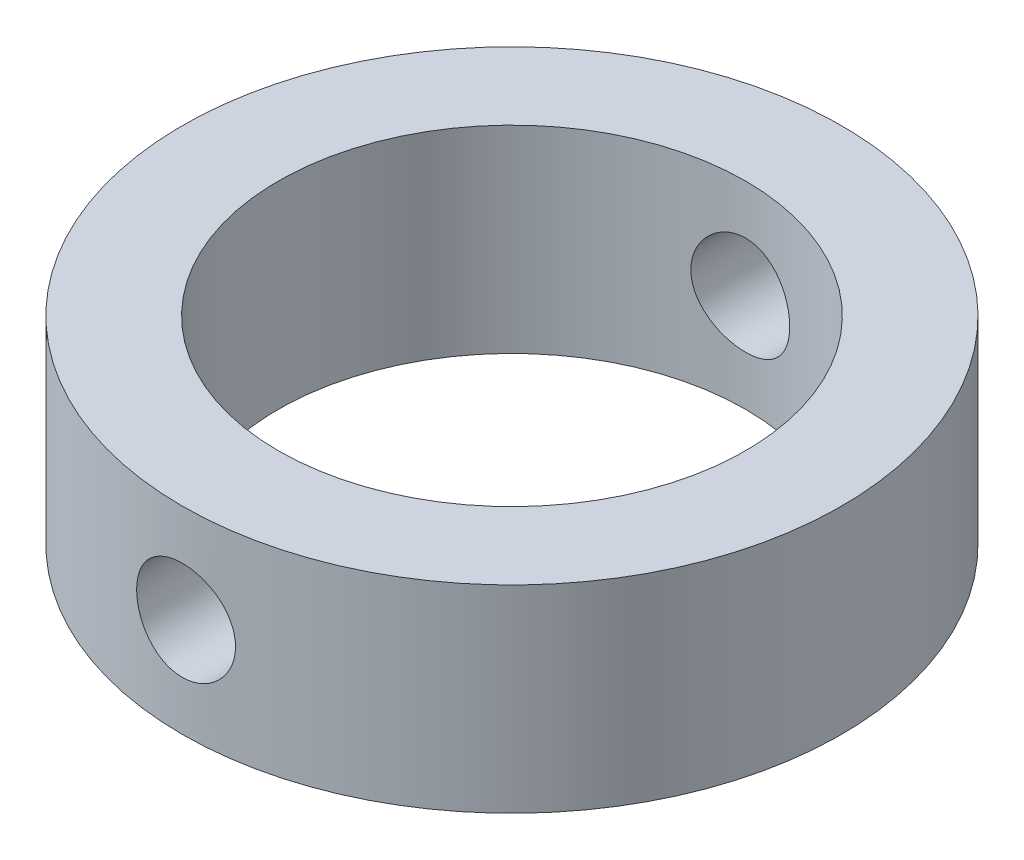
ISO-10303-21;
HEADER;
FILE_DESCRIPTION(('STEP AP214'),'2;1');
FILE_NAME('part.step','',(''),(''),'','','');
FILE_SCHEMA(('AUTOMOTIVE_DESIGN { 1 0 10303 214 1 1 1 1 }'));
ENDSEC;
DATA;
#1=APPLICATION_CONTEXT('core data for automotive mechanical design processes');
#2=APPLICATION_PROTOCOL_DEFINITION('international standard','automotive_design',2000,#1);
#3=PRODUCT_CONTEXT('',#1,'mechanical');
#4=PRODUCT('Part','Part','',(#3));
#5=PRODUCT_RELATED_PRODUCT_CATEGORY('part','',(#4));
#6=PRODUCT_DEFINITION_FORMATION('','',#4);
#7=PRODUCT_DEFINITION_CONTEXT('part definition',#1,'design');
#8=PRODUCT_DEFINITION('design','',#6,#7);
#9=PRODUCT_DEFINITION_SHAPE('','',#8);
#10=(LENGTH_UNIT() NAMED_UNIT(*) SI_UNIT(.MILLI.,.METRE.));
#11=(NAMED_UNIT(*) PLANE_ANGLE_UNIT() SI_UNIT($,.RADIAN.));
#12=(NAMED_UNIT(*) SI_UNIT($,.STERADIAN.) SOLID_ANGLE_UNIT());
#13=UNCERTAINTY_MEASURE_WITH_UNIT(LENGTH_MEASURE(1.E-05),#10,'distance_accuracy_value','');
#14=(GEOMETRIC_REPRESENTATION_CONTEXT(3) GLOBAL_UNCERTAINTY_ASSIGNED_CONTEXT((#13)) GLOBAL_UNIT_ASSIGNED_CONTEXT((#10,
#11,#12)) REPRESENTATION_CONTEXT('',''));
#15=CARTESIAN_POINT('',(0.,0.,0.));
#16=DIRECTION('',(0.,0.,1.));
#17=DIRECTION('',(1.,0.,0.));
#18=AXIS2_PLACEMENT_3D('',#15,#16,#17);
#19=CARTESIAN_POINT('',(0.,7.50000000000001,0.));
#20=DIRECTION('',(0.,1.,0.));
#21=DIRECTION('',(0.,0.,1.));
#22=AXIS2_PLACEMENT_3D('',#19,#20,#21);
#23=PLANE('',#22);
#24=CARTESIAN_POINT('',(0.,7.50000000000001,0.));
#25=DIRECTION('',(0.,1.,0.));
#26=DIRECTION('',(0.,0.,1.));
#27=AXIS2_PLACEMENT_3D('',#24,#25,#26);
#28=CIRCLE('',#27,25.);
#29=CARTESIAN_POINT('',(0.,7.50000000000001,25.));
#30=VERTEX_POINT('',#29);
#31=EDGE_CURVE('E10',#30,#30,#28,.T.);
#32=ORIENTED_EDGE('',*,*,#31,.T.);
#33=EDGE_LOOP('',(#32));
#34=FACE_BOUND('',#33,.T.);
#35=CARTESIAN_POINT('',(0.,7.50000000000001,0.));
#36=DIRECTION('',(0.,1.,0.));
#37=DIRECTION('',(0.,0.,1.));
#38=AXIS2_PLACEMENT_3D('',#35,#36,#37);
#39=CIRCLE('',#38,17.7222);
#40=CARTESIAN_POINT('',(0.,7.50000000000001,17.7222));
#41=VERTEX_POINT('',#40);
#42=EDGE_CURVE('E67',#41,#41,#39,.T.);
#43=ORIENTED_EDGE('',*,*,#42,.F.);
#44=EDGE_LOOP('',(#43));
#45=FACE_BOUND('',#44,.T.);
#46=ADVANCED_FACE('F44',(#34,#45),#23,.T.);
#47=CARTESIAN_POINT('',(0.,-7.50000000000001,0.));
#48=DIRECTION('',(0.,1.,0.));
#49=DIRECTION('',(0.,0.,1.));
#50=AXIS2_PLACEMENT_3D('',#47,#48,#49);
#51=PLANE('',#50);
#52=CARTESIAN_POINT('',(0.,-7.50000000000001,0.));
#53=DIRECTION('',(0.,1.,0.));
#54=DIRECTION('',(0.,0.,1.));
#55=AXIS2_PLACEMENT_3D('',#52,#53,#54);
#56=CIRCLE('',#55,25.);
#57=CARTESIAN_POINT('',(0.,-7.50000000000001,25.));
#58=VERTEX_POINT('',#57);
#59=EDGE_CURVE('E59',#58,#58,#56,.T.);
#60=ORIENTED_EDGE('',*,*,#59,.F.);
#61=EDGE_LOOP('',(#60));
#62=FACE_BOUND('',#61,.T.);
#63=CARTESIAN_POINT('',(0.,-7.50000000000001,0.));
#64=DIRECTION('',(0.,1.,0.));
#65=DIRECTION('',(0.,0.,1.));
#66=AXIS2_PLACEMENT_3D('',#63,#64,#65);
#67=CIRCLE('',#66,17.7222);
#68=CARTESIAN_POINT('',(0.,-7.50000000000001,17.7222));
#69=VERTEX_POINT('',#68);
#70=EDGE_CURVE('E70',#69,#69,#67,.T.);
#71=ORIENTED_EDGE('',*,*,#70,.T.);
#72=EDGE_LOOP('',(#71));
#73=FACE_BOUND('',#72,.T.);
#74=ADVANCED_FACE('F115',(#62,#73),#51,.F.);
#75=CARTESIAN_POINT('',(0.,7.50000000000001,0.));
#76=DIRECTION('',(0.,-1.,0.));
#77=DIRECTION('',(0.,0.,-1.));
#78=AXIS2_PLACEMENT_3D('',#75,#76,#77);
#79=CYLINDRICAL_SURFACE('',#78,25.);
#80=CARTESIAN_POINT('',(0.,3.74999999999998,-25.));
#81=CARTESIAN_POINT('',(-0.209378861204106,3.74999136546187,-24.9999966442824));
#82=CARTESIAN_POINT('',(-0.41887921270533,3.7324049978984,-24.997342063426));
#83=CARTESIAN_POINT('',(-0.832024069987285,3.66254200004314,-24.9870078993297));
#84=CARTESIAN_POINT('',(-1.03566267243558,3.61023159263779,-24.9793234234618));
#85=CARTESIAN_POINT('',(-1.43104521555465,3.47251873758097,-24.9597930304881));
#86=CARTESIAN_POINT('',(-1.62279801956699,3.38714130123514,-24.947950259273));
#87=CARTESIAN_POINT('',(-1.98922607158813,3.18577905145784,-24.9214118977931));
#88=CARTESIAN_POINT('',(-2.16390368681297,3.06979848895659,-24.9067167038193));
#89=CARTESIAN_POINT('',(-2.49261679890531,2.80955683765031,-24.8759792747863));
#90=CARTESIAN_POINT('',(-2.64649958056375,2.66510385947948,-24.8599283472583));
#91=CARTESIAN_POINT('',(-2.92793726672371,2.35243077776534,-24.828356528331));
#92=CARTESIAN_POINT('',(-3.0554906568234,2.18420930805372,-24.8128356674626));
#93=CARTESIAN_POINT('',(-3.28124323749857,1.8277483911938,-24.7839969364681));
#94=CARTESIAN_POINT('',(-3.37929467593011,1.63941438254668,-24.7706902993758));
#95=CARTESIAN_POINT('',(-3.54231580427639,1.24871794838645,-24.7479052826567));
#96=CARTESIAN_POINT('',(-3.60728729722907,1.04635628814029,-24.7384266943862));
#97=CARTESIAN_POINT('',(-3.70182996997278,0.634954895320726,-24.7244564054669));
#98=CARTESIAN_POINT('',(-3.73166259101294,0.425976516479948,-24.7199278935313));
#99=CARTESIAN_POINT('',(-3.75589060084831,0.00593458503179794,-24.7162587242645));
#100=CARTESIAN_POINT('',(-3.75028802434491,-0.205128847156248,-24.7171177575787));
#101=CARTESIAN_POINT('',(-3.70401833126969,-0.621502700485371,-24.7240929588102));
#102=CARTESIAN_POINT('',(-3.66364239819375,-0.826846316212019,-24.7301654690387));
#103=CARTESIAN_POINT('',(-3.54942793509335,-1.22781092217884,-24.7468152031592));
#104=CARTESIAN_POINT('',(-3.4755884584453,-1.42343163720187,-24.7573925544845));
#105=CARTESIAN_POINT('',(-3.29624008824341,-1.80028342820716,-24.781908388637));
#106=CARTESIAN_POINT('',(-3.19060785707994,-1.98145492273098,-24.7958599191632));
#107=CARTESIAN_POINT('',(-2.95076032822386,-2.32361148945484,-24.8255426893637));
#108=CARTESIAN_POINT('',(-2.81654315456195,-2.48459523567344,-24.8412740458125));
#109=CARTESIAN_POINT('',(-2.5217373269562,-2.7834941518493,-24.8729368264052));
#110=CARTESIAN_POINT('',(-2.360898324105,-2.92116247571585,-24.8888686778204));
#111=CARTESIAN_POINT('',(-2.01826772473546,-3.16758983626815,-24.9189911912115));
#112=CARTESIAN_POINT('',(-1.83647603647042,-3.27634874635974,-24.9331818455628));
#113=CARTESIAN_POINT('',(-1.45688649553421,-3.46188271624886,-24.9582378896348));
#114=CARTESIAN_POINT('',(-1.25907919459195,-3.53863872960074,-24.9691012981357));
#115=CARTESIAN_POINT('',(-0.853182956217649,-3.65777347421344,-24.9862622639267));
#116=CARTESIAN_POINT('',(-0.6450947148815,-3.70015452953895,-24.9925601298867));
#117=CARTESIAN_POINT('',(-0.226673919109115,-3.74900807454175,-24.9998395283468));
#118=CARTESIAN_POINT('',(-0.0163818296761745,-3.75581992844831,-25.0008713022597));
#119=CARTESIAN_POINT('',(0.402341694155708,-3.73424248672244,-24.9976390253807));
#120=CARTESIAN_POINT('',(0.610773185954693,-3.70585428082975,-24.9933751385342));
#121=CARTESIAN_POINT('',(1.01883096857852,-3.61496474955615,-24.9800617153833));
#122=CARTESIAN_POINT('',(1.2184949076996,-3.55262875992289,-24.9710353801996));
#123=CARTESIAN_POINT('',(1.6045373966075,-3.39578750634561,-24.9492058914592));
#124=CARTESIAN_POINT('',(1.79091532198775,-3.30128073166592,-24.9364025605391));
#125=CARTESIAN_POINT('',(2.1465874482298,-3.08198443859034,-24.9083170617172));
#126=CARTESIAN_POINT('',(2.31574752472892,-2.95697964996806,-24.8930175406686));
#127=CARTESIAN_POINT('',(2.63080918294427,-2.68053547092813,-24.8616965753041));
#128=CARTESIAN_POINT('',(2.77670941198351,-2.52909454418838,-24.8456750890717));
#129=CARTESIAN_POINT('',(3.04234462392989,-2.20256616705877,-24.8145566076123));
#130=CARTESIAN_POINT('',(3.16185211868553,-2.02729268701307,-24.7994684004397));
#131=CARTESIAN_POINT('',(3.36972823176461,-1.65895989872056,-24.7720804776226));
#132=CARTESIAN_POINT('',(3.4580976914109,-1.46590107119632,-24.7597806866407));
#133=CARTESIAN_POINT('',(3.60083668309858,-1.06815616594216,-24.7394258252161));
#134=CARTESIAN_POINT('',(3.65532592854089,-0.863513847571883,-24.731355825161));
#135=CARTESIAN_POINT('',(3.72913873753966,-0.447852461412236,-24.7203345574451));
#136=CARTESIAN_POINT('',(3.74846472957666,-0.236833835013324,-24.7173829362943));
#137=CARTESIAN_POINT('',(3.751344666736,0.183322658289436,-24.716945815271));
#138=CARTESIAN_POINT('',(3.73525630418282,0.392458104392283,-24.7194056583375));
#139=CARTESIAN_POINT('',(3.66853073860947,0.80501315830877,-24.7293955152794));
#140=CARTESIAN_POINT('',(3.61789359096568,1.00843277528346,-24.7369255210279));
#141=CARTESIAN_POINT('',(3.48363433796663,1.40368270558579,-24.7561881528074));
#142=CARTESIAN_POINT('',(3.40003723310785,1.59552167608359,-24.7679175929019));
#143=CARTESIAN_POINT('',(3.20226669105772,1.96250908450601,-24.7942613639425));
#144=CARTESIAN_POINT('',(3.08809221853755,2.13765695700913,-24.8088757925681));
#145=CARTESIAN_POINT('',(2.83110844147911,2.46810764493795,-24.8395185841234));
#146=CARTESIAN_POINT('',(2.68803422599514,2.62320333311767,-24.8555591970492));
#147=CARTESIAN_POINT('',(2.37787210270709,2.90731138696955,-24.8871447206659));
#148=CARTESIAN_POINT('',(2.21077862087735,3.03631768144039,-24.902689515269));
#149=CARTESIAN_POINT('',(1.8562392688593,3.2652191915184,-24.931629644763));
#150=CARTESIAN_POINT('',(1.6686864419119,3.36495027303686,-24.9450126782205));
#151=CARTESIAN_POINT('',(1.2793796756218,3.53134629189512,-24.968000720074));
#152=CARTESIAN_POINT('',(1.07764069274176,3.59804547513423,-24.9776096391439));
#153=CARTESIAN_POINT('',(0.72916431972332,3.68135335677528,-24.9897734815376));
#154=CARTESIAN_POINT('',(0.584577833738195,3.70705650384704,-24.9935887294889));
#155=CARTESIAN_POINT('',(0.293347429000313,3.7413827442816,-24.9987031486974));
#156=CARTESIAN_POINT('',(0.146703535836043,3.75000604988134,-25.0000023512194));
#157=CARTESIAN_POINT('',(0.,3.74999999999998,-25.));
#158=B_SPLINE_CURVE_WITH_KNOTS('',3,(#80,#81,#82,#83,#84,#85,#86,#87,#88,#89,#90,#91,#92,#93,
#94,#95,#96,#97,#98,#99,#100,#101,#102,#103,#104,#105,#106,#107,#108,#109,#110,#111,#112,#113,
#114,#115,#116,#117,#118,#119,#120,#121,#122,#123,#124,#125,#126,#127,#128,#129,#130,#131,#132,
#133,#134,#135,#136,#137,#138,#139,#140,#141,#142,#143,#144,#145,#146,#147,#148,#149,#150,#151,
#152,#153,#154,#155,#156,#157),.UNSPECIFIED.,.T.,.F.,(4,2,2,2,2,2,2,2,2,2,2,2,2,2,2,2,2,2,2,2,2,
2,2,2,2,2,2,2,2,2,2,2,2,2,2,2,2,2,4),(0.,0.62760051257916,1.25581240732287,1.88355005895809,
2.511200560494,3.14323540342108,3.77530658931448,4.41049255988435,5.04564390563763,
5.67603911514811,6.30639812747458,6.93152942989367,7.55667841725904,8.18428458690398,
8.81193195771337,9.44585728138522,10.0797853809667,10.7140902246219,11.348352179835,
11.9765514636064,12.6047312997789,13.2298787241487,13.8550555094068,14.4847797009227,
15.1145405007157,15.7495341646168,16.3845106702208,17.0172305864292,17.6499068034294,
18.2762222065266,18.9025366057391,19.5283768496037,20.154238286672,20.786120749143,
21.4181500867183,22.0536580846183,22.688505831536,23.1282462994702,23.5679813030823),.UNSPECIFIED.);
#159=CARTESIAN_POINT('',(0.,3.74999999999998,-25.));
#160=VERTEX_POINT('',#159);
#161=EDGE_CURVE('E97',#160,#160,#158,.T.);
#162=ORIENTED_EDGE('',*,*,#161,.T.);
#163=EDGE_LOOP('',(#162));
#164=FACE_BOUND('',#163,.T.);
#165=CARTESIAN_POINT('',(3.75,0.,24.7171499166065));
#166=CARTESIAN_POINT('',(3.74999135268076,-0.209363923243862,24.7171534162569));
#167=CARTESIAN_POINT('',(3.73240740970164,-0.4188493769331,24.7198387912912));
#168=CARTESIAN_POINT('',(3.66255491641441,-0.831963287259849,24.7302828678189));
#169=CARTESIAN_POINT('',(3.61025253506452,-1.03558582871036,24.7380465176796));
#170=CARTESIAN_POINT('',(3.47256315245608,-1.43093438859889,24.757748475261));
#171=CARTESIAN_POINT('',(3.38720154203599,-1.62266940635047,24.7696835784506));
#172=CARTESIAN_POINT('',(3.18587657719372,-1.98906757693512,24.7963798526664));
#173=CARTESIAN_POINT('',(3.06991743574651,-2.16373307553706,24.8111406345481));
#174=CARTESIAN_POINT('',(2.80969756046425,-2.49245954188449,24.8419572312449));
#175=CARTESIAN_POINT('',(2.66524013962059,-2.6463640335165,24.8580215614632));
#176=CARTESIAN_POINT('',(2.35254901361086,-2.9278437141391,24.8895592042144));
#177=CARTESIAN_POINT('',(2.1843140019663,-3.05541745541756,24.9050324842122));
#178=CARTESIAN_POINT('',(1.82784089513188,-3.2811915792283,24.9337336857078));
#179=CARTESIAN_POINT('',(1.63951056841442,-3.37924787580612,24.9469504608901));
#180=CARTESIAN_POINT('',(1.24882212526743,-3.54227899702046,24.9695551686593));
#181=CARTESIAN_POINT('',(1.04646475067669,-3.60725556960723,24.9789433035484));
#182=CARTESIAN_POINT('',(0.635077807726422,-3.70180847132708,24.9927728699448));
#183=CARTESIAN_POINT('',(0.426109710974664,-3.7316468159679,24.9972508971837));
#184=CARTESIAN_POINT('',(0.00608801004869675,-3.75588983706225,25.0008811192395));
#185=CARTESIAN_POINT('',(-0.204965477539366,-3.75029648329923,25.0000336101235));
#186=CARTESIAN_POINT('',(-0.621379295501299,-3.70404165559394,24.9931374915199));
#187=CARTESIAN_POINT('',(-0.826771728500019,-3.66366207052129,24.987130691312));
#188=CARTESIAN_POINT('',(-1.22783207285784,-3.54942348419356,24.9706375056963));
#189=CARTESIAN_POINT('',(-1.42349973378371,-3.4755636212464,24.9601510049935));
#190=CARTESIAN_POINT('',(-1.80040945192579,-3.29617250770726,24.9358048468301));
#191=CARTESIAN_POINT('',(-1.98159418080899,-3.19052258722815,24.921932587891));
#192=CARTESIAN_POINT('',(-2.32376976787545,-2.95063701582503,24.8923609561355));
#193=CARTESIAN_POINT('',(-2.48475929567934,-2.81639948323284,24.8766614630796));
#194=CARTESIAN_POINT('',(-2.78363620680661,-2.52157887793353,24.8450039548157));
#195=CARTESIAN_POINT('',(-2.92128082377367,-2.36074969507472,24.8290449155814));
#196=CARTESIAN_POINT('',(-3.16766498347032,-2.01814730719066,24.7988176113381));
#197=CARTESIAN_POINT('',(-3.27640434819997,-1.83637397320019,24.7845493567412));
#198=CARTESIAN_POINT('',(-3.46192411336512,-1.45679009264838,24.7593193821714));
#199=CARTESIAN_POINT('',(-3.53867955675204,-1.25896716584402,24.7483602461323));
#200=CARTESIAN_POINT('',(-3.65780840522199,-0.853036862131513,24.7310350724765));
#201=CARTESIAN_POINT('',(-3.70018423343315,-0.6449302111331,24.7246687111575));
#202=CARTESIAN_POINT('',(-3.74901800216639,-0.22649977605626,24.7173112848757));
#203=CARTESIAN_POINT('',(-3.75582008162631,-0.0162170294961455,24.7162687200644));
#204=CARTESIAN_POINT('',(-3.73422642549548,0.402485487043363,24.7195401984288));
#205=CARTESIAN_POINT('',(-3.70583178205756,0.610905314626933,24.7238540753945));
#206=CARTESIAN_POINT('',(-3.61494257381915,1.0188995449141,24.7373050615363));
#207=CARTESIAN_POINT('',(-3.55261946319551,1.21851301235403,24.7464179120715));
#208=CARTESIAN_POINT('',(-3.39582079867716,1.60446023012154,24.7684200456442));
#209=CARTESIAN_POINT('',(-3.30134365690972,1.79079332407052,24.7813095151794));
#210=CARTESIAN_POINT('',(-3.08209194988309,2.14643315083763,24.8095338921766));
#211=CARTESIAN_POINT('',(-2.95709461404415,2.31560111819955,24.8248864819997));
#212=CARTESIAN_POINT('',(-2.68066042093003,2.63068214968452,24.8562539858339));
#213=CARTESIAN_POINT('',(-2.52922206861698,2.77659389795286,24.8722689372573));
#214=CARTESIAN_POINT('',(-2.20268904907046,3.04225651658394,24.9033176304347));
#215=CARTESIAN_POINT('',(-2.02740781692989,3.16177932060619,24.9183420865106));
#216=CARTESIAN_POINT('',(-1.6590552006592,3.36968226315661,24.9455726258004));
#217=CARTESIAN_POINT('',(-1.46598430340109,3.45806325366257,24.9577787861141));
#218=CARTESIAN_POINT('',(-1.06824498965286,3.60080935622007,24.9779567415199));
#219=CARTESIAN_POINT('',(-0.863622146885755,3.6552991676959,24.9859440429474));
#220=CARTESIAN_POINT('',(-0.448002038752981,3.72911969884368,24.9968494164225));
#221=CARTESIAN_POINT('',(-0.237005195326448,3.74845274062284,24.9997678232702));
#222=CARTESIAN_POINT('',(0.18316147715204,3.75135426137352,25.0002032264784));
#223=CARTESIAN_POINT('',(0.392328925530112,3.73527170219247,24.9977729255942));
#224=CARTESIAN_POINT('',(0.804949488307786,3.66854652894807,24.9878902629792));
#225=CARTESIAN_POINT('',(1.00840262099135,3.61790402547846,24.9804379173192));
#226=CARTESIAN_POINT('',(1.40372343594909,3.48362031107453,24.9613446685591));
#227=CARTESIAN_POINT('',(1.59559948287171,3.40000326215315,24.9497068329142));
#228=CARTESIAN_POINT('',(1.96265279474175,3.20218128004165,24.9235208623969));
#229=CARTESIAN_POINT('',(2.13782951730268,3.08797535379732,24.9089726330436));
#230=CARTESIAN_POINT('',(2.46828146297899,2.83095575292895,24.878412765869));
#231=CARTESIAN_POINT('',(2.62335516611253,2.68788443546613,24.8623887105156));
#232=CARTESIAN_POINT('',(2.90742020976012,2.37773731729184,24.830775042358));
#233=CARTESIAN_POINT('',(3.03640541998738,2.21065589041309,24.8151855324038));
#234=CARTESIAN_POINT('',(3.26528277056406,1.85612754194085,24.7861121002282));
#235=CARTESIAN_POINT('',(3.36500735723655,1.66857145753498,24.7726405020556));
#236=CARTESIAN_POINT('',(3.53139034675771,1.27925805818213,24.7494727259703));
#237=CARTESIAN_POINT('',(3.59808306436243,1.07751573037934,24.7397726323382));
#238=CARTESIAN_POINT('',(3.68137379725668,0.729056409346079,24.7274871383702));
#239=CARTESIAN_POINT('',(3.70706924451177,0.58449150768439,24.7236312345417));
#240=CARTESIAN_POINT('',(3.74138526441309,0.293304270669045,24.7184614141931));
#241=CARTESIAN_POINT('',(3.75000605837784,0.14668196200793,24.7171474647247));
#242=CARTESIAN_POINT('',(3.75,0.,24.7171499166065));
#243=B_SPLINE_CURVE_WITH_KNOTS('',3,(#165,#166,#167,#168,#169,#170,#171,#172,#173,#174,#175,
#176,#177,#178,#179,#180,#181,#182,#183,#184,#185,#186,#187,#188,#189,#190,#191,#192,#193,#194,
#195,#196,#197,#198,#199,#200,#201,#202,#203,#204,#205,#206,#207,#208,#209,#210,#211,#212,#213,
#214,#215,#216,#217,#218,#219,#220,#221,#222,#223,#224,#225,#226,#227,#228,#229,#230,#231,#232,
#233,#234,#235,#236,#237,#238,#239,#240,#241,#242),.UNSPECIFIED.,.T.,.F.,(4,2,2,2,2,2,2,2,2,2,2,
2,2,2,2,2,2,2,2,2,2,2,2,2,2,2,2,2,2,2,2,2,2,2,2,2,2,2,4),(0.,0.627555629539278,1.25572367395714,
1.88341021339182,2.51101037170595,3.14310396628032,3.77523230524807,4.41039805269719,
5.04553023416515,5.67589581341256,6.30622634853698,6.93149656294584,7.55678287103768,
8.18443290971398,8.81212427378444,9.44598861670937,10.0798568629114,10.7142187943811,
11.3485360111612,11.9767053651462,12.6048552275506,13.229859870237,13.8548953822056,
14.4846371500852,15.1144145365977,15.7494384438905,16.384444976849,17.0171010223299,
17.6497152793145,18.2761240906108,18.9025308973732,19.5284795564985,20.1544485392303,
20.7862737503269,21.4182472559742,22.0537719706901,22.688635086223,23.1283110473742,
23.5679813094887),.UNSPECIFIED.);
#244=CARTESIAN_POINT('',(3.75,0.,24.7171499166065));
#245=VERTEX_POINT('',#244);
#246=EDGE_CURVE('E91',#245,#245,#243,.T.);
#247=ORIENTED_EDGE('',*,*,#246,.T.);
#248=EDGE_LOOP('',(#247));
#249=FACE_BOUND('',#248,.T.);
#250=ORIENTED_EDGE('',*,*,#31,.F.);
#251=EDGE_LOOP('',(#250));
#252=FACE_BOUND('',#251,.T.);
#253=ORIENTED_EDGE('',*,*,#59,.T.);
#254=EDGE_LOOP('',(#253));
#255=FACE_BOUND('',#254,.T.);
#256=ADVANCED_FACE('F46',(#164,#249,#252,#255),#79,.T.);
#257=CARTESIAN_POINT('',(0.,7.50000000000001,0.));
#258=DIRECTION('',(0.,-1.,0.));
#259=DIRECTION('',(0.,0.,-1.));
#260=AXIS2_PLACEMENT_3D('',#257,#258,#259);
#261=CYLINDRICAL_SURFACE('',#260,17.7222);
#262=CARTESIAN_POINT('',(0.,3.74999999999998,-17.7222));
#263=CARTESIAN_POINT('',(-0.208152185255152,3.74999266653267,-17.7221961470917));
#264=CARTESIAN_POINT('',(-0.41639454894016,3.73261053478915,-17.718495379831));
#265=CARTESIAN_POINT('',(-0.82697549267229,3.66360681046194,-17.7040895405869));
#266=CARTESIAN_POINT('',(-1.02930955229037,3.61195968317287,-17.6933792450956));
#267=CARTESIAN_POINT('',(-1.4220797859961,3.47610707502514,-17.6661482075854));
#268=CARTESIAN_POINT('',(-1.612527762323,3.3919345074086,-17.6496333408684));
#269=CARTESIAN_POINT('',(-1.97658898228258,3.1935222719406,-17.6125806048195));
#270=CARTESIAN_POINT('',(-2.15020288067077,3.07928377413531,-17.5920428920488));
#271=CARTESIAN_POINT('',(-2.47829359232655,2.82215911265837,-17.5488523402332));
#272=CARTESIAN_POINT('',(-2.63248026690015,2.67890686784265,-17.5261746803597));
#273=CARTESIAN_POINT('',(-2.91482531722673,2.36860744686158,-17.4814372368369));
#274=CARTESIAN_POINT('',(-3.0429814883738,2.20155825729426,-17.4593775056581));
#275=CARTESIAN_POINT('',(-3.27089013313798,1.84628433118979,-17.4181298435129));
#276=CARTESIAN_POINT('',(-3.37033702804904,1.65785953759665,-17.398973770749));
#277=CARTESIAN_POINT('',(-3.53604503663322,1.26650138054312,-17.3660571970979));
#278=CARTESIAN_POINT('',(-3.60230984632562,1.06356963583257,-17.3522960953235));
#279=CARTESIAN_POINT('',(-3.69882038915951,0.652095534338813,-17.3319797145479));
#280=CARTESIAN_POINT('',(-3.72957803284,0.44367840257558,-17.325322132504));
#281=CARTESIAN_POINT('',(-3.75579222040198,0.0245439529289904,-17.3196590845325));
#282=CARTESIAN_POINT('',(-3.75125281635522,-0.186173098152194,-17.3206527402489));
#283=CARTESIAN_POINT('',(-3.70741447312024,-0.600144024076815,-17.3300871453066));
#284=CARTESIAN_POINT('',(-3.66870712250094,-0.803463870180767,-17.3384011430383));
#285=CARTESIAN_POINT('',(-3.55856755059544,-1.20065708434444,-17.3613393781391));
#286=CARTESIAN_POINT('',(-3.48713359938168,-1.39452995243762,-17.3759639490826));
#287=CARTESIAN_POINT('',(-3.3130169457595,-1.76900525558975,-17.4100022405893));
#288=CARTESIAN_POINT('',(-3.21010404075646,-1.94949733471914,-17.4294510352031));
#289=CARTESIAN_POINT('',(-2.97611287763404,-2.29087060233029,-17.4709244872574));
#290=CARTESIAN_POINT('',(-2.84503101428523,-2.45174927643813,-17.4929494742497));
#291=CARTESIAN_POINT('',(-2.55527727463654,-2.75273797748361,-17.5376395639383));
#292=CARTESIAN_POINT('',(-2.39610160950076,-2.89236288513993,-17.5603086103753));
#293=CARTESIAN_POINT('',(-2.05634155221086,-3.14301199068524,-17.6033266007612));
#294=CARTESIAN_POINT('',(-1.87575681901751,-3.25403573287791,-17.6236755077411));
#295=CARTESIAN_POINT('',(-1.49773346902194,-3.44443897454558,-17.6598199907713));
#296=CARTESIAN_POINT('',(-1.30026354782879,-3.5237580802098,-17.6756068609576));
#297=CARTESIAN_POINT('',(-0.894390959853441,-3.64795660986314,-17.7007833304223));
#298=CARTESIAN_POINT('',(-0.685989782919562,-3.69284071412211,-17.7101737990549));
#299=CARTESIAN_POINT('',(-0.268334585437967,-3.74619689441788,-17.7213767146153));
#300=CARTESIAN_POINT('',(-0.0591688756376419,-3.75533211518441,-17.7233271572078));
#301=CARTESIAN_POINT('',(0.357699882223733,-3.7387241455296,-17.7198156294982));
#302=CARTESIAN_POINT('',(0.565403021980799,-3.71298316160336,-17.7143541281237));
#303=CARTESIAN_POINT('',(0.971276090111958,-3.62790381593627,-17.6967191722838));
#304=CARTESIAN_POINT('',(1.16952157037204,-3.56891032691673,-17.6846146482463));
#305=CARTESIAN_POINT('',(1.55330482716889,-3.41938105298411,-17.6550473164882));
#306=CARTESIAN_POINT('',(1.73884156867098,-3.32884270261685,-17.6375840729719));
#307=CARTESIAN_POINT('',(2.09470415857252,-3.11739146103108,-17.5988945431411));
#308=CARTESIAN_POINT('',(2.26479098769048,-2.99608521007218,-17.5776206615175));
#309=CARTESIAN_POINT('',(2.5824324460133,-2.72706296083509,-17.5337723095124));
#310=CARTESIAN_POINT('',(2.72998434524564,-2.57934376748426,-17.5111976820089));
#311=CARTESIAN_POINT('',(3.00096508318142,-2.25865490461321,-17.4668199433546));
#312=CARTESIAN_POINT('',(3.12393621131072,-2.08529522089939,-17.4450367352952));
#313=CARTESIAN_POINT('',(3.33901833475105,-1.7199930120902,-17.4051527897));
#314=CARTESIAN_POINT('',(3.43113063232395,-1.52805127160994,-17.3870518967809));
#315=CARTESIAN_POINT('',(3.5812796624344,-1.13204333544177,-17.3567474486069));
#316=CARTESIAN_POINT('',(3.63950291210935,-0.928050444144708,-17.3445116801737));
#317=CARTESIAN_POINT('',(3.72077563508814,-0.512886650899571,-17.3272605713025));
#318=CARTESIAN_POINT('',(3.74383032158951,-0.301716817567705,-17.3222441607122));
#319=CARTESIAN_POINT('',(3.75390077642337,0.117199436329279,-17.3200640777949));
#320=CARTESIAN_POINT('',(3.74164125208719,0.324927945921498,-17.3227424916424));
#321=CARTESIAN_POINT('',(3.6830433466586,0.735288357102404,-17.3352948169723));
#322=CARTESIAN_POINT('',(3.63670531509406,0.937920310942116,-17.3451686546543));
#323=CARTESIAN_POINT('',(3.51160559451979,1.33180466845612,-17.3709247713923));
#324=CARTESIAN_POINT('',(3.43294291003997,1.52308979591756,-17.3867886919825));
#325=CARTESIAN_POINT('',(3.2455143852809,1.88985734059801,-17.4227459150073));
#326=CARTESIAN_POINT('',(3.13674564350965,2.06533823251138,-17.4428396250459));
#327=CARTESIAN_POINT('',(2.88976091302207,2.39910281812074,-17.4854685786902));
#328=CARTESIAN_POINT('',(2.75102571999953,2.55699738504185,-17.5080428894493));
#329=CARTESIAN_POINT('',(2.44910638381815,2.84750315660893,-17.5528201552829));
#330=CARTESIAN_POINT('',(2.28591661359643,2.98010852614178,-17.5750230235769));
#331=CARTESIAN_POINT('',(1.93736830904406,3.21778392758599,-17.6168703527083));
#332=CARTESIAN_POINT('',(1.75176776880861,3.32250531498017,-17.6364810034619));
#333=CARTESIAN_POINT('',(1.36522969361138,3.49910204168294,-17.6705978681026));
#334=CARTESIAN_POINT('',(1.16430557538415,3.57100573817274,-17.6851084863342));
#335=CARTESIAN_POINT('',(0.802566208000677,3.66667443463992,-17.7047108510407));
#336=CARTESIAN_POINT('',(0.643749678729262,3.69786345280609,-17.7112295441063));
#337=CARTESIAN_POINT('',(0.323306828576754,3.73952867830156,-17.7199755309738));
#338=CARTESIAN_POINT('',(0.16168061790495,3.75000569621462,-17.722202992717));
#339=CARTESIAN_POINT('',(0.,3.74999999999998,-17.7222));
#340=B_SPLINE_CURVE_WITH_KNOTS('',3,(#262,#263,#264,#265,#266,#267,#268,#269,#270,#271,#272,
#273,#274,#275,#276,#277,#278,#279,#280,#281,#282,#283,#284,#285,#286,#287,#288,#289,#290,#291,
#292,#293,#294,#295,#296,#297,#298,#299,#300,#301,#302,#303,#304,#305,#306,#307,#308,#309,#310,
#311,#312,#313,#314,#315,#316,#317,#318,#319,#320,#321,#322,#323,#324,#325,#326,#327,#328,#329,
#330,#331,#332,#333,#334,#335,#336,#337,#338,#339),.UNSPECIFIED.,.T.,.F.,(4,2,2,2,2,2,2,2,2,2,2,
2,2,2,2,2,2,2,2,2,2,2,2,2,2,2,2,2,2,2,2,2,2,2,2,2,2,2,4),(0.,0.623864874495568,1.24819518393421,
1.87189536666159,2.49557128105162,3.12767066593478,3.7598235630179,4.39847591563496,
5.0370571154976,5.66631208782473,6.29549482327059,6.91399290307351,7.53252368044719,
8.1556904691464,8.77893706195789,9.41477203996356,10.0506171479673,10.687667763103,
11.3246317774797,11.9497224253038,12.5747735276825,13.1934582426495,13.81219328524,
14.4392769101839,15.0664364424179,15.7043646908095,16.3422660148394,16.976622450319,
17.6108848430917,18.2322244050554,18.8535575943087,19.473001771584,20.0925056690176,
20.7237549900906,21.3551497869745,21.9941033399093,22.6325037343333,23.1171049698507,
23.6016872396644),.UNSPECIFIED.);
#341=CARTESIAN_POINT('',(0.,3.74999999999998,-17.7222));
#342=VERTEX_POINT('',#341);
#343=EDGE_CURVE('E49',#342,#342,#340,.T.);
#344=ORIENTED_EDGE('',*,*,#343,.F.);
#345=EDGE_LOOP('',(#344));
#346=FACE_BOUND('',#345,.T.);
#347=CARTESIAN_POINT('',(3.75,0.,17.3209085454545));
#348=CARTESIAN_POINT('',(3.74999262317846,-0.208093377559216,17.3209127403599));
#349=CARTESIAN_POINT('',(3.73261997860774,-0.41627704426552,17.3246994128075));
#350=CARTESIAN_POINT('',(3.66365734999549,-0.82673613295852,17.3394113210448));
#351=CARTESIAN_POINT('',(3.61204159866975,-1.02900698590625,17.35034193242));
#352=CARTESIAN_POINT('',(3.47628071020747,-1.42164331670556,17.378049597833));
#353=CARTESIAN_POINT('',(3.3921699578918,-1.61202113271457,17.3948204701126));
#354=CARTESIAN_POINT('',(3.19390346373044,-1.97596394029922,17.4323116003607));
#355=CARTESIAN_POINT('',(3.07974875129999,-2.14952950764491,17.4530317230068));
#356=CARTESIAN_POINT('',(2.8227102243032,-2.47767122093244,17.4964528436146));
#357=CARTESIAN_POINT('',(2.67944149998641,-2.63194274311314,17.5191777906157));
#358=CARTESIAN_POINT('',(2.36907303755115,-2.9144525696,17.5638379340189));
#359=CARTESIAN_POINT('',(2.20197152130571,-3.04268892973225,17.5857730713415));
#360=CARTESIAN_POINT('',(1.84664821708077,-3.27068435862293,17.6266419499506));
#361=CARTESIAN_POINT('',(1.65823536178029,-3.37015179600751,17.6455441445425));
#362=CARTESIAN_POINT('',(1.26690298543268,-3.53590103120925,17.6779474301966));
#363=CARTESIAN_POINT('',(1.06398498883088,-3.60218631052539,17.6914490878576));
#364=CARTESIAN_POINT('',(0.652567580719959,-3.69873534853722,17.7113608065571));
#365=CARTESIAN_POINT('',(0.444194041340712,-3.7295142314838,17.7178721830305));
#366=CARTESIAN_POINT('',(0.0251460275708574,-3.75578602313321,17.7234202773815));
#367=CARTESIAN_POINT('',(-0.185528197367947,-3.75128272010942,17.7224577977324));
#368=CARTESIAN_POINT('',(-0.599650668847661,-3.70750438089793,17.7132444762233));
#369=CARTESIAN_POINT('',(-0.803160564023222,-3.66878443670728,17.7051099896601));
#370=CARTESIAN_POINT('',(-1.20072724293188,-3.55855488407318,17.6825986819167));
#371=CARTESIAN_POINT('',(-1.39478361731767,-3.48704385713527,17.668221590692));
#372=CARTESIAN_POINT('',(-1.76949226205794,-3.31276204154235,17.6346515461538));
#373=CARTESIAN_POINT('',(-1.95004234186693,-3.20977809359904,17.6154259149491));
#374=CARTESIAN_POINT('',(-2.2915020832145,-2.97563223175987,17.574271331142));
#375=CARTESIAN_POINT('',(-2.45240922613981,-2.84446671036701,17.552342032599));
#376=CARTESIAN_POINT('',(-2.75331424766758,-2.5546498054732,17.5076914056489));
#377=CARTESIAN_POINT('',(-2.89284352514332,-2.3955125821641,17.4849629705469));
#378=CARTESIAN_POINT('',(-3.14331748073308,-2.05586476772887,17.4416780316321));
#379=CARTESIAN_POINT('',(-3.25426148100089,-1.87535366990952,17.4211215793306));
#380=CARTESIAN_POINT('',(-3.44460544567757,-1.4973577262115,17.3844910940221));
#381=CARTESIAN_POINT('',(-3.52392183288319,-1.29982956327181,17.3684289703895));
#382=CARTESIAN_POINT('',(-3.64809745225986,-0.893829338665766,17.3427742763144));
#383=CARTESIAN_POINT('',(-3.69296176518216,-0.68535889553681,17.3331807519537));
#384=CARTESIAN_POINT('',(-3.74624324397612,-0.267660091110112,17.321742710072));
#385=CARTESIAN_POINT('',(-3.75534053082154,-0.0585223454091618,17.3197536124913));
#386=CARTESIAN_POINT('',(-3.73866669739234,0.358281689094897,17.3233603789464));
#387=CARTESIAN_POINT('',(-3.71289780756497,0.565948071169309,17.3289557577907));
#388=CARTESIAN_POINT('',(-3.62781175603405,0.971578538198272,17.3469649281265));
#389=CARTESIAN_POINT('',(-3.56886480360998,1.1696239282128,17.3593034347226));
#390=CARTESIAN_POINT('',(-3.41949479846595,1.55302736673519,17.3893414522287));
#391=CARTESIAN_POINT('',(-3.32906889399048,1.73838426394022,17.4070414488305));
#392=CARTESIAN_POINT('',(-3.11779340887312,2.09410517830178,17.4461285497627));
#393=CARTESIAN_POINT('',(-2.99652228144575,2.26421325550393,17.467565329004));
#394=CARTESIAN_POINT('',(-2.72755439164383,2.58191367667266,17.5115775650937));
#395=CARTESIAN_POINT('',(-2.57985456808567,2.72950340871106,17.5341531536303));
#396=CARTESIAN_POINT('',(-2.25915377249306,3.000593538018,17.5783730388198));
#397=CARTESIAN_POINT('',(-2.08575840667883,3.12363173147599,17.5999943920104));
#398=CARTESIAN_POINT('',(-1.72036426394338,3.33883143800125,17.6394568181403));
#399=CARTESIAN_POINT('',(-1.52836632473975,3.43099434062302,17.6572980611917));
#400=CARTESIAN_POINT('',(-1.13237181293257,3.58117182698285,17.6870928075675));
#401=CARTESIAN_POINT('',(-0.928456948272547,3.63939444068021,17.6990821038446));
#402=CARTESIAN_POINT('',(-0.513459944970105,3.7206922216256,17.7159763748215));
#403=CARTESIAN_POINT('',(-0.302378782011162,3.74377215404811,17.7208823099854));
#404=CARTESIAN_POINT('',(0.116560832719898,3.75392671639739,17.7230308401985));
#405=CARTESIAN_POINT('',(0.324402062843804,3.74169327597626,17.7204207074236));
#406=CARTESIAN_POINT('',(0.734994933660259,3.6831082704523,17.7081436067736));
#407=CARTESIAN_POINT('',(0.937746654628523,3.63675724382879,17.698476750275));
#408=CARTESIAN_POINT('',(1.33191041798982,3.51157522396491,17.6731806640817));
#409=CARTESIAN_POINT('',(1.52335293699509,3.43283654961418,17.6575683907202));
#410=CARTESIAN_POINT('',(1.89040430753438,3.24520668754175,17.6220539549752));
#411=CARTESIAN_POINT('',(2.066011728651,3.13631277944471,17.6021514055916));
#412=CARTESIAN_POINT('',(2.39980151247036,2.88917687962351,17.5597884397093));
#413=CARTESIAN_POINT('',(2.55761616742306,2.75044494942397,17.5372886507353));
#414=CARTESIAN_POINT('',(2.84796223724989,2.44856669830367,17.4924874475652));
#415=CARTESIAN_POINT('',(2.98048759586126,2.28541454589567,17.4701860821035));
#416=CARTESIAN_POINT('',(3.21805989106317,1.93690896749649,17.4280016019896));
#417=CARTESIAN_POINT('',(3.32274774875285,1.75130653135795,17.408151706626));
#418=CARTESIAN_POINT('',(3.49928129047303,1.36476790591703,17.3735304123889));
#419=CARTESIAN_POINT('',(3.57115555676738,1.16384524003873,17.3587545965321));
#420=CARTESIAN_POINT('',(3.6667550315034,0.802180592249884,17.3387719502576));
#421=CARTESIAN_POINT('',(3.69791362140267,0.643441629825071,17.3321164661325));
#422=CARTESIAN_POINT('',(3.73953852764503,0.323153182302085,17.3231832284598));
#423=CARTESIAN_POINT('',(3.75000572878646,0.161603817679431,17.3209052877212));
#424=CARTESIAN_POINT('',(3.75,0.,17.3209085454545));
#425=B_SPLINE_CURVE_WITH_KNOTS('',3,(#347,#348,#349,#350,#351,#352,#353,#354,#355,#356,#357,
#358,#359,#360,#361,#362,#363,#364,#365,#366,#367,#368,#369,#370,#371,#372,#373,#374,#375,#376,
#377,#378,#379,#380,#381,#382,#383,#384,#385,#386,#387,#388,#389,#390,#391,#392,#393,#394,#395,
#396,#397,#398,#399,#400,#401,#402,#403,#404,#405,#406,#407,#408,#409,#410,#411,#412,#413,#414,
#415,#416,#417,#418,#419,#420,#421,#422,#423,#424),.UNSPECIFIED.,.T.,.F.,(4,2,2,2,2,2,2,2,2,2,2,
2,2,2,2,2,2,2,2,2,2,2,2,2,2,2,2,2,2,2,2,2,2,2,2,2,2,2,4),(0.,0.623688090543528,1.24784602759235,
1.87134530840723,2.49482322865155,3.12715391539679,3.75953180403848,4.39811185432497,
5.03662489022361,5.66575306846345,6.29481369768978,6.91385275136084,7.53291858628582,
8.15627379990392,8.77970885623474,9.41529368384851,10.0508935817771,10.6881621200715,
11.3253366603958,11.9503347936719,12.5752929466693,13.1934120958477,13.8115872565353,
14.4387129619278,15.0659113531267,15.7039879007302,16.3420357275908,16.9761304972284,
17.6101392790794,18.2318101300843,18.853471169442,19.4733723505521,20.0933294726496,
20.7243716110697,21.3555646818814,21.9945428733454,22.6329634162214,23.1173358066245,
23.6016874840072),.UNSPECIFIED.);
#426=CARTESIAN_POINT('',(3.75,0.,17.3209085454545));
#427=VERTEX_POINT('',#426);
#428=EDGE_CURVE('E72',#427,#427,#425,.T.);
#429=ORIENTED_EDGE('',*,*,#428,.F.);
#430=EDGE_LOOP('',(#429));
#431=FACE_BOUND('',#430,.T.);
#432=ORIENTED_EDGE('',*,*,#42,.T.);
#433=EDGE_LOOP('',(#432));
#434=FACE_BOUND('',#433,.T.);
#435=ORIENTED_EDGE('',*,*,#70,.F.);
#436=EDGE_LOOP('',(#435));
#437=FACE_BOUND('',#436,.T.);
#438=ADVANCED_FACE('F78',(#346,#431,#434,#437),#261,.F.);
#439=CARTESIAN_POINT('',(0.,0.,-25.));
#440=DIRECTION('',(0.,0.,1.));
#441=DIRECTION('',(1.,0.,0.));
#442=AXIS2_PLACEMENT_3D('',#439,#440,#441);
#443=CYLINDRICAL_SURFACE('',#442,3.75);
#444=ORIENTED_EDGE('',*,*,#428,.T.);
#445=EDGE_LOOP('',(#444));
#446=FACE_BOUND('',#445,.T.);
#447=ORIENTED_EDGE('',*,*,#246,.F.);
#448=EDGE_LOOP('',(#447));
#449=FACE_BOUND('',#448,.T.);
#450=ADVANCED_FACE('F84',(#446,#449),#443,.F.);
#451=ORIENTED_EDGE('',*,*,#343,.T.);
#452=EDGE_LOOP('',(#451));
#453=FACE_BOUND('',#452,.T.);
#454=ORIENTED_EDGE('',*,*,#161,.F.);
#455=EDGE_LOOP('',(#454));
#456=FACE_BOUND('',#455,.T.);
#457=ADVANCED_FACE('F81',(#453,#456),#443,.F.);
#458=CLOSED_SHELL('',(#46,#74,#256,#438,#450,#457));
#459=MANIFOLD_SOLID_BREP('B2',#458);
#460=ADVANCED_BREP_SHAPE_REPRESENTATION('',(#18,#459),#14);
#461=SHAPE_DEFINITION_REPRESENTATION(#9,#460);
ENDSEC;
END-ISO-10303-21;
